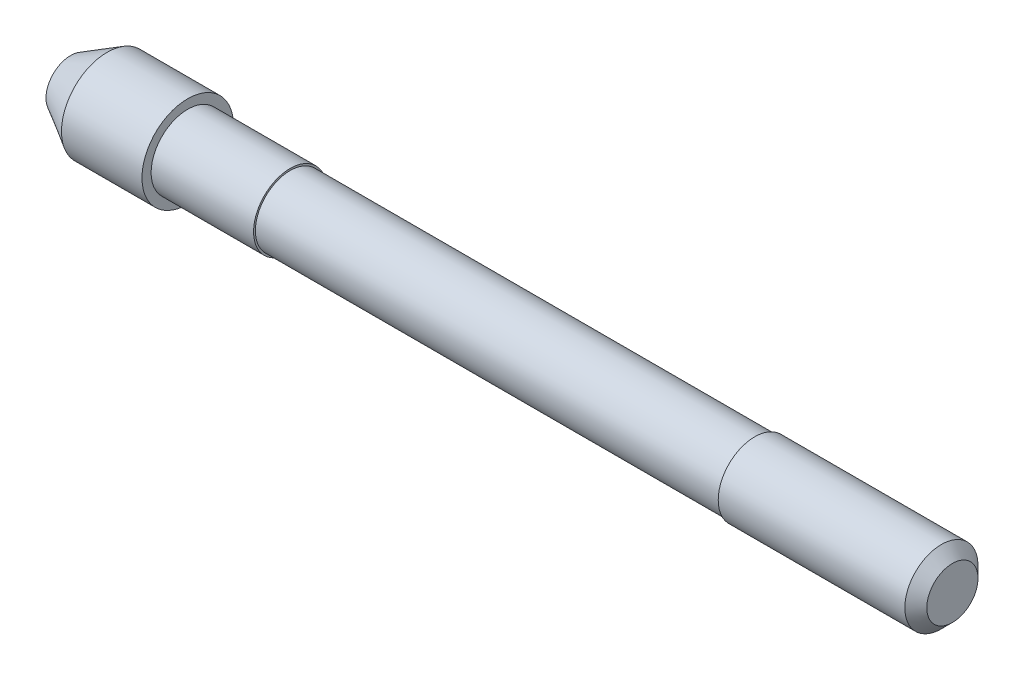
ISO-10303-21;
HEADER;
FILE_DESCRIPTION(('STEP AP214'),'2;1');
FILE_NAME('part.step','',(''),(''),'','','');
FILE_SCHEMA(('AUTOMOTIVE_DESIGN { 1 0 10303 214 1 1 1 1 }'));
ENDSEC;
DATA;
#1=APPLICATION_CONTEXT('core data for automotive mechanical design processes');
#2=APPLICATION_PROTOCOL_DEFINITION('international standard','automotive_design',2000,#1);
#3=PRODUCT_CONTEXT('',#1,'mechanical');
#4=PRODUCT('Part','Part','',(#3));
#5=PRODUCT_RELATED_PRODUCT_CATEGORY('part','',(#4));
#6=PRODUCT_DEFINITION_FORMATION('','',#4);
#7=PRODUCT_DEFINITION_CONTEXT('part definition',#1,'design');
#8=PRODUCT_DEFINITION('design','',#6,#7);
#9=PRODUCT_DEFINITION_SHAPE('','',#8);
#10=(LENGTH_UNIT() NAMED_UNIT(*) SI_UNIT(.MILLI.,.METRE.));
#11=(NAMED_UNIT(*) PLANE_ANGLE_UNIT() SI_UNIT($,.RADIAN.));
#12=(NAMED_UNIT(*) SI_UNIT($,.STERADIAN.) SOLID_ANGLE_UNIT());
#13=UNCERTAINTY_MEASURE_WITH_UNIT(LENGTH_MEASURE(1.E-05),#10,'distance_accuracy_value','');
#14=(GEOMETRIC_REPRESENTATION_CONTEXT(3) GLOBAL_UNCERTAINTY_ASSIGNED_CONTEXT((#13)) GLOBAL_UNIT_ASSIGNED_CONTEXT((#10,
#11,#12)) REPRESENTATION_CONTEXT('',''));
#15=CARTESIAN_POINT('',(0.,0.,0.));
#16=DIRECTION('',(0.,0.,1.));
#17=DIRECTION('',(1.,0.,0.));
#18=AXIS2_PLACEMENT_3D('',#15,#16,#17);
#19=CARTESIAN_POINT('',(12.05,0.,0.));
#20=DIRECTION('',(-1.,0.,0.));
#21=DIRECTION('',(0.,0.,1.));
#22=AXIS2_PLACEMENT_3D('',#19,#20,#21);
#23=PLANE('',#22);
#24=CARTESIAN_POINT('',(12.05,0.,0.));
#25=DIRECTION('',(-1.,0.,0.));
#26=DIRECTION('',(0.,0.,1.));
#27=AXIS2_PLACEMENT_3D('',#24,#25,#26);
#28=CIRCLE('',#27,0.699999999999996);
#29=CARTESIAN_POINT('',(12.05,0.,0.699999999999996));
#30=VERTEX_POINT('',#29);
#31=EDGE_CURVE('E10',#30,#30,#28,.F.);
#32=ORIENTED_EDGE('',*,*,#31,.T.);
#33=EDGE_LOOP('',(#32));
#34=FACE_BOUND('',#33,.T.);
#35=ADVANCED_FACE('F34',(#34),#23,.F.);
#36=CARTESIAN_POINT('',(-12.05,0.,0.));
#37=DIRECTION('',(-1.,0.,0.));
#38=DIRECTION('',(0.,0.,1.));
#39=AXIS2_PLACEMENT_3D('',#36,#37,#38);
#40=CYLINDRICAL_SURFACE('',#39,1.);
#41=CARTESIAN_POINT('',(11.75,0.,0.));
#42=DIRECTION('',(-1.,0.,0.));
#43=DIRECTION('',(0.,0.,1.));
#44=AXIS2_PLACEMENT_3D('',#41,#42,#43);
#45=CIRCLE('',#44,1.);
#46=CARTESIAN_POINT('',(11.75,0.,1.));
#47=VERTEX_POINT('',#46);
#48=EDGE_CURVE('E42',#47,#47,#45,.T.);
#49=ORIENTED_EDGE('',*,*,#48,.T.);
#50=EDGE_LOOP('',(#49));
#51=FACE_BOUND('',#50,.T.);
#52=CARTESIAN_POINT('',(6.65,0.,0.));
#53=DIRECTION('',(-1.,0.,0.));
#54=DIRECTION('',(0.,0.,1.));
#55=AXIS2_PLACEMENT_3D('',#52,#53,#54);
#56=CIRCLE('',#55,0.999999999999999);
#57=CARTESIAN_POINT('',(6.65,0.,0.999999999999999));
#58=VERTEX_POINT('',#57);
#59=EDGE_CURVE('E48',#58,#58,#56,.T.);
#60=ORIENTED_EDGE('',*,*,#59,.F.);
#61=EDGE_LOOP('',(#60));
#62=FACE_BOUND('',#61,.T.);
#63=ADVANCED_FACE('F124',(#51,#62),#40,.T.);
#64=CARTESIAN_POINT('',(6.65,0.999999999999999,0.));
#65=DIRECTION('',(1.,0.,0.));
#66=DIRECTION('',(0.,0.,-1.));
#67=AXIS2_PLACEMENT_3D('',#64,#65,#66);
#68=PLANE('',#67);
#69=CARTESIAN_POINT('',(6.65,0.,0.));
#70=DIRECTION('',(-1.,0.,0.));
#71=DIRECTION('',(0.,0.,1.));
#72=AXIS2_PLACEMENT_3D('',#69,#70,#71);
#73=CIRCLE('',#72,0.95);
#74=CARTESIAN_POINT('',(6.65,0.,0.95));
#75=VERTEX_POINT('',#74);
#76=EDGE_CURVE('E54',#75,#75,#73,.T.);
#77=ORIENTED_EDGE('',*,*,#76,.F.);
#78=EDGE_LOOP('',(#77));
#79=FACE_BOUND('',#78,.T.);
#80=ORIENTED_EDGE('',*,*,#59,.T.);
#81=EDGE_LOOP('',(#80));
#82=FACE_BOUND('',#81,.T.);
#83=ADVANCED_FACE('F118',(#79,#82),#68,.F.);
#84=CARTESIAN_POINT('',(-12.05,0.,0.));
#85=DIRECTION('',(-1.,0.,0.));
#86=DIRECTION('',(0.,0.,1.));
#87=AXIS2_PLACEMENT_3D('',#84,#85,#86);
#88=CYLINDRICAL_SURFACE('',#87,0.949999999999999);
#89=CARTESIAN_POINT('',(-6.05,0.,0.));
#90=DIRECTION('',(-1.,0.,0.));
#91=DIRECTION('',(0.,0.,1.));
#92=AXIS2_PLACEMENT_3D('',#89,#90,#91);
#93=CIRCLE('',#92,0.949999999999999);
#94=CARTESIAN_POINT('',(-6.05,0.,0.949999999999999));
#95=VERTEX_POINT('',#94);
#96=EDGE_CURVE('E59',#95,#95,#93,.T.);
#97=ORIENTED_EDGE('',*,*,#96,.F.);
#98=EDGE_LOOP('',(#97));
#99=FACE_BOUND('',#98,.T.);
#100=ORIENTED_EDGE('',*,*,#76,.T.);
#101=EDGE_LOOP('',(#100));
#102=FACE_BOUND('',#101,.T.);
#103=ADVANCED_FACE('F112',(#99,#102),#88,.T.);
#104=CARTESIAN_POINT('',(-6.05,0.949999999999999,0.));
#105=DIRECTION('',(-1.,0.,0.));
#106=DIRECTION('',(0.,0.,1.));
#107=AXIS2_PLACEMENT_3D('',#104,#105,#106);
#108=PLANE('',#107);
#109=CARTESIAN_POINT('',(-6.05,0.,0.));
#110=DIRECTION('',(-1.,0.,0.));
#111=DIRECTION('',(0.,0.,1.));
#112=AXIS2_PLACEMENT_3D('',#109,#110,#111);
#113=CIRCLE('',#112,0.999999999999999);
#114=CARTESIAN_POINT('',(-6.05,0.,0.999999999999999));
#115=VERTEX_POINT('',#114);
#116=EDGE_CURVE('E63',#115,#115,#113,.T.);
#117=ORIENTED_EDGE('',*,*,#116,.F.);
#118=EDGE_LOOP('',(#117));
#119=FACE_BOUND('',#118,.T.);
#120=ORIENTED_EDGE('',*,*,#96,.T.);
#121=EDGE_LOOP('',(#120));
#122=FACE_BOUND('',#121,.T.);
#123=ADVANCED_FACE('F106',(#119,#122),#108,.F.);
#124=CARTESIAN_POINT('',(-12.05,0.,0.));
#125=DIRECTION('',(-1.,0.,0.));
#126=DIRECTION('',(0.,0.,1.));
#127=AXIS2_PLACEMENT_3D('',#124,#125,#126);
#128=CYLINDRICAL_SURFACE('',#127,0.999999999999999);
#129=CARTESIAN_POINT('',(-8.85,0.,0.));
#130=DIRECTION('',(-1.,0.,0.));
#131=DIRECTION('',(0.,0.,1.));
#132=AXIS2_PLACEMENT_3D('',#129,#130,#131);
#133=CIRCLE('',#132,1.);
#134=CARTESIAN_POINT('',(-8.85,0.,1.));
#135=VERTEX_POINT('',#134);
#136=EDGE_CURVE('E67',#135,#135,#133,.T.);
#137=ORIENTED_EDGE('',*,*,#136,.F.);
#138=EDGE_LOOP('',(#137));
#139=FACE_BOUND('',#138,.T.);
#140=ORIENTED_EDGE('',*,*,#116,.T.);
#141=EDGE_LOOP('',(#140));
#142=FACE_BOUND('',#141,.T.);
#143=ADVANCED_FACE('F100',(#139,#142),#128,.T.);
#144=CARTESIAN_POINT('',(-8.85,1.,0.));
#145=DIRECTION('',(-1.,0.,0.));
#146=DIRECTION('',(0.,0.,1.));
#147=AXIS2_PLACEMENT_3D('',#144,#145,#146);
#148=PLANE('',#147);
#149=CARTESIAN_POINT('',(-8.85,0.,0.));
#150=DIRECTION('',(-1.,0.,0.));
#151=DIRECTION('',(0.,0.,1.));
#152=AXIS2_PLACEMENT_3D('',#149,#150,#151);
#153=CIRCLE('',#152,1.25);
#154=CARTESIAN_POINT('',(-8.85,0.,1.25));
#155=VERTEX_POINT('',#154);
#156=EDGE_CURVE('E71',#155,#155,#153,.T.);
#157=ORIENTED_EDGE('',*,*,#156,.F.);
#158=EDGE_LOOP('',(#157));
#159=FACE_BOUND('',#158,.T.);
#160=ORIENTED_EDGE('',*,*,#136,.T.);
#161=EDGE_LOOP('',(#160));
#162=FACE_BOUND('',#161,.T.);
#163=ADVANCED_FACE('F94',(#159,#162),#148,.F.);
#164=CARTESIAN_POINT('',(-12.05,0.,0.));
#165=DIRECTION('',(-1.,0.,0.));
#166=DIRECTION('',(0.,0.,1.));
#167=AXIS2_PLACEMENT_3D('',#164,#165,#166);
#168=CYLINDRICAL_SURFACE('',#167,1.25);
#169=CARTESIAN_POINT('',(-11.05,0.,0.));
#170=DIRECTION('',(-1.,0.,0.));
#171=DIRECTION('',(0.,0.,1.));
#172=AXIS2_PLACEMENT_3D('',#169,#170,#171);
#173=CIRCLE('',#172,1.25);
#174=CARTESIAN_POINT('',(-11.05,0.,1.25));
#175=VERTEX_POINT('',#174);
#176=EDGE_CURVE('E74',#175,#175,#173,.T.);
#177=ORIENTED_EDGE('',*,*,#176,.F.);
#178=EDGE_LOOP('',(#177));
#179=FACE_BOUND('',#178,.T.);
#180=ORIENTED_EDGE('',*,*,#156,.T.);
#181=EDGE_LOOP('',(#180));
#182=FACE_BOUND('',#181,.T.);
#183=ADVANCED_FACE('F88',(#179,#182),#168,.T.);
#184=CARTESIAN_POINT('',(-11.05,0.,0.));
#185=DIRECTION('',(1.,0.,0.));
#186=DIRECTION('',(0.,0.,-1.));
#187=AXIS2_PLACEMENT_3D('',#184,#185,#186);
#188=CONICAL_SURFACE('',#187,1.25,0.523598775598293);
#189=CARTESIAN_POINT('',(-12.05,0.,0.));
#190=DIRECTION('',(-1.,0.,0.));
#191=DIRECTION('',(0.,0.,1.));
#192=AXIS2_PLACEMENT_3D('',#189,#190,#191);
#193=CIRCLE('',#192,0.672649730810382);
#194=CARTESIAN_POINT('',(-12.05,0.,0.672649730810382));
#195=VERTEX_POINT('',#194);
#196=EDGE_CURVE('E78',#195,#195,#193,.T.);
#197=ORIENTED_EDGE('',*,*,#196,.F.);
#198=EDGE_LOOP('',(#197));
#199=FACE_BOUND('',#198,.T.);
#200=ORIENTED_EDGE('',*,*,#176,.T.);
#201=EDGE_LOOP('',(#200));
#202=FACE_BOUND('',#201,.T.);
#203=ADVANCED_FACE('F85',(#199,#202),#188,.T.);
#204=CARTESIAN_POINT('',(-12.05,0.672649730810382,0.));
#205=DIRECTION('',(1.,0.,0.));
#206=DIRECTION('',(0.,0.,-1.));
#207=AXIS2_PLACEMENT_3D('',#204,#205,#206);
#208=PLANE('',#207);
#209=ORIENTED_EDGE('',*,*,#196,.T.);
#210=EDGE_LOOP('',(#209));
#211=FACE_BOUND('',#210,.T.);
#212=ADVANCED_FACE('F83',(#211),#208,.F.);
#213=CARTESIAN_POINT('',(11.75,0.,0.));
#214=DIRECTION('',(-1.,0.,0.));
#215=DIRECTION('',(0.,0.,1.));
#216=AXIS2_PLACEMENT_3D('',#213,#214,#215);
#217=CONICAL_SURFACE('',#216,1.,0.785398163397458);
#218=ORIENTED_EDGE('',*,*,#31,.F.);
#219=EDGE_LOOP('',(#218));
#220=FACE_BOUND('',#219,.T.);
#221=ORIENTED_EDGE('',*,*,#48,.F.);
#222=EDGE_LOOP('',(#221));
#223=FACE_BOUND('',#222,.T.);
#224=ADVANCED_FACE('F36',(#220,#223),#217,.T.);
#225=CLOSED_SHELL('',(#35,#63,#83,#103,#123,#143,#163,#183,#203,#212,#224));
#226=MANIFOLD_SOLID_BREP('B2',#225);
#227=ADVANCED_BREP_SHAPE_REPRESENTATION('',(#18,#226),#14);
#228=SHAPE_DEFINITION_REPRESENTATION(#9,#227);
ENDSEC;
END-ISO-10303-21;
